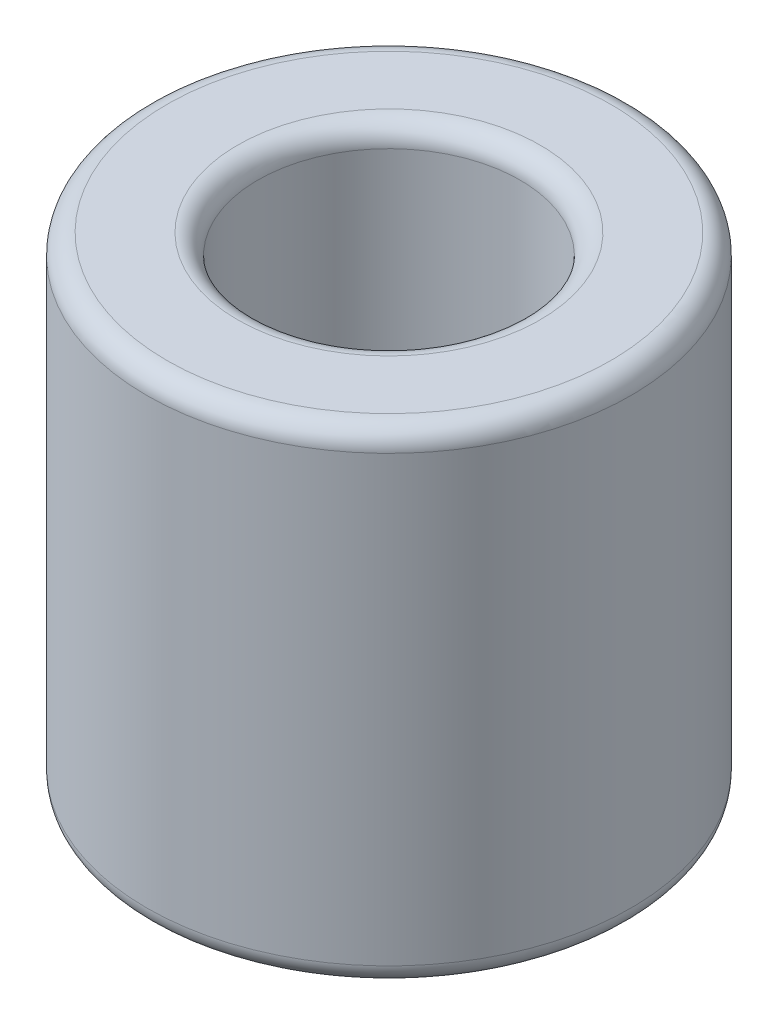
ISO-10303-21;
HEADER;
FILE_DESCRIPTION(('STEP AP214'),'2;1');
FILE_NAME('part.step','',(''),(''),'','','');
FILE_SCHEMA(('AUTOMOTIVE_DESIGN { 1 0 10303 214 1 1 1 1 }'));
ENDSEC;
DATA;
#1=APPLICATION_CONTEXT('core data for automotive mechanical design processes');
#2=APPLICATION_PROTOCOL_DEFINITION('international standard','automotive_design',2000,#1);
#3=PRODUCT_CONTEXT('',#1,'mechanical');
#4=PRODUCT('Part','Part','',(#3));
#5=PRODUCT_RELATED_PRODUCT_CATEGORY('part','',(#4));
#6=PRODUCT_DEFINITION_FORMATION('','',#4);
#7=PRODUCT_DEFINITION_CONTEXT('part definition',#1,'design');
#8=PRODUCT_DEFINITION('design','',#6,#7);
#9=PRODUCT_DEFINITION_SHAPE('','',#8);
#10=(LENGTH_UNIT() NAMED_UNIT(*) SI_UNIT(.MILLI.,.METRE.));
#11=(NAMED_UNIT(*) PLANE_ANGLE_UNIT() SI_UNIT($,.RADIAN.));
#12=(NAMED_UNIT(*) SI_UNIT($,.STERADIAN.) SOLID_ANGLE_UNIT());
#13=UNCERTAINTY_MEASURE_WITH_UNIT(LENGTH_MEASURE(1.E-05),#10,'distance_accuracy_value','');
#14=(GEOMETRIC_REPRESENTATION_CONTEXT(3) GLOBAL_UNCERTAINTY_ASSIGNED_CONTEXT((#13)) GLOBAL_UNIT_ASSIGNED_CONTEXT((#10,
#11,#12)) REPRESENTATION_CONTEXT('',''));
#15=CARTESIAN_POINT('',(0.,0.,0.));
#16=DIRECTION('',(0.,0.,1.));
#17=DIRECTION('',(1.,0.,0.));
#18=AXIS2_PLACEMENT_3D('',#15,#16,#17);
#19=CARTESIAN_POINT('',(0.,6.,0.));
#20=DIRECTION('',(0.,1.,0.));
#21=DIRECTION('',(0.,0.,1.));
#22=AXIS2_PLACEMENT_3D('',#19,#20,#21);
#23=PLANE('',#22);
#24=CARTESIAN_POINT('',(0.,6.,0.));
#25=DIRECTION('',(0.,1.,0.));
#26=DIRECTION('',(0.,0.,1.));
#27=AXIS2_PLACEMENT_3D('',#24,#25,#26);
#28=CIRCLE('',#27,1.875);
#29=CARTESIAN_POINT('',(0.,6.,1.875));
#30=VERTEX_POINT('',#29);
#31=EDGE_CURVE('E10',#30,#30,#28,.F.);
#32=ORIENTED_EDGE('',*,*,#31,.T.);
#33=EDGE_LOOP('',(#32));
#34=FACE_BOUND('',#33,.T.);
#35=CARTESIAN_POINT('',(0.,6.,0.));
#36=DIRECTION('',(0.,1.,0.));
#37=DIRECTION('',(0.,0.,1.));
#38=AXIS2_PLACEMENT_3D('',#35,#36,#37);
#39=CIRCLE('',#38,2.75);
#40=CARTESIAN_POINT('',(0.,6.,2.75));
#41=VERTEX_POINT('',#40);
#42=EDGE_CURVE('E39',#41,#41,#39,.T.);
#43=ORIENTED_EDGE('',*,*,#42,.T.);
#44=EDGE_LOOP('',(#43));
#45=FACE_BOUND('',#44,.T.);
#46=ADVANCED_FACE('F32',(#34,#45),#23,.T.);
#47=CARTESIAN_POINT('',(0.,0.,0.));
#48=DIRECTION('',(0.,1.,0.));
#49=DIRECTION('',(0.,0.,1.));
#50=AXIS2_PLACEMENT_3D('',#47,#48,#49);
#51=PLANE('',#50);
#52=CARTESIAN_POINT('',(0.,0.,0.));
#53=DIRECTION('',(0.,1.,0.));
#54=DIRECTION('',(0.,0.,1.));
#55=AXIS2_PLACEMENT_3D('',#52,#53,#54);
#56=CIRCLE('',#55,1.875);
#57=CARTESIAN_POINT('',(0.,0.,1.875));
#58=VERTEX_POINT('',#57);
#59=EDGE_CURVE('E58',#58,#58,#56,.T.);
#60=ORIENTED_EDGE('',*,*,#59,.T.);
#61=EDGE_LOOP('',(#60));
#62=FACE_BOUND('',#61,.T.);
#63=CARTESIAN_POINT('',(0.,0.,0.));
#64=DIRECTION('',(0.,1.,0.));
#65=DIRECTION('',(0.,0.,1.));
#66=AXIS2_PLACEMENT_3D('',#63,#64,#65);
#67=CIRCLE('',#66,2.75);
#68=CARTESIAN_POINT('',(0.,0.,2.75));
#69=VERTEX_POINT('',#68);
#70=EDGE_CURVE('E61',#69,#69,#67,.F.);
#71=ORIENTED_EDGE('',*,*,#70,.T.);
#72=EDGE_LOOP('',(#71));
#73=FACE_BOUND('',#72,.T.);
#74=ADVANCED_FACE('F65',(#62,#73),#51,.F.);
#75=CARTESIAN_POINT('',(0.,6.,0.));
#76=DIRECTION('',(0.,-1.,0.));
#77=DIRECTION('',(0.,0.,-1.));
#78=AXIS2_PLACEMENT_3D('',#75,#76,#77);
#79=CYLINDRICAL_SURFACE('',#78,3.);
#80=CARTESIAN_POINT('',(0.,0.25,0.));
#81=DIRECTION('',(0.,1.,0.));
#82=DIRECTION('',(0.,0.,1.));
#83=AXIS2_PLACEMENT_3D('',#80,#81,#82);
#84=CIRCLE('',#83,3.);
#85=CARTESIAN_POINT('',(0.,0.25,3.));
#86=VERTEX_POINT('',#85);
#87=EDGE_CURVE('E43',#86,#86,#84,.T.);
#88=ORIENTED_EDGE('',*,*,#87,.T.);
#89=EDGE_LOOP('',(#88));
#90=FACE_BOUND('',#89,.T.);
#91=CARTESIAN_POINT('',(0.,5.75,0.));
#92=DIRECTION('',(0.,1.,0.));
#93=DIRECTION('',(0.,0.,1.));
#94=AXIS2_PLACEMENT_3D('',#91,#92,#93);
#95=CIRCLE('',#94,3.);
#96=CARTESIAN_POINT('',(0.,5.75,3.));
#97=VERTEX_POINT('',#96);
#98=EDGE_CURVE('E47',#97,#97,#95,.F.);
#99=ORIENTED_EDGE('',*,*,#98,.T.);
#100=EDGE_LOOP('',(#99));
#101=FACE_BOUND('',#100,.T.);
#102=ADVANCED_FACE('F75',(#90,#101),#79,.T.);
#103=CARTESIAN_POINT('',(0.,6.,0.));
#104=DIRECTION('',(0.,-1.,0.));
#105=DIRECTION('',(0.,0.,-1.));
#106=AXIS2_PLACEMENT_3D('',#103,#104,#105);
#107=CYLINDRICAL_SURFACE('',#106,1.625);
#108=CARTESIAN_POINT('',(0.,0.25,0.));
#109=DIRECTION('',(0.,1.,0.));
#110=DIRECTION('',(0.,0.,1.));
#111=AXIS2_PLACEMENT_3D('',#108,#109,#110);
#112=CIRCLE('',#111,1.625);
#113=CARTESIAN_POINT('',(0.,0.25,1.625));
#114=VERTEX_POINT('',#113);
#115=EDGE_CURVE('E52',#114,#114,#112,.F.);
#116=ORIENTED_EDGE('',*,*,#115,.T.);
#117=EDGE_LOOP('',(#116));
#118=FACE_BOUND('',#117,.T.);
#119=CARTESIAN_POINT('',(0.,5.75,0.));
#120=DIRECTION('',(0.,1.,0.));
#121=DIRECTION('',(0.,0.,1.));
#122=AXIS2_PLACEMENT_3D('',#119,#120,#121);
#123=CIRCLE('',#122,1.625);
#124=CARTESIAN_POINT('',(0.,5.75,1.625));
#125=VERTEX_POINT('',#124);
#126=EDGE_CURVE('E55',#125,#125,#123,.T.);
#127=ORIENTED_EDGE('',*,*,#126,.T.);
#128=EDGE_LOOP('',(#127));
#129=FACE_BOUND('',#128,.T.);
#130=ADVANCED_FACE('F78',(#118,#129),#107,.F.);
#131=CARTESIAN_POINT('',(0.,0.25,0.));
#132=DIRECTION('',(0.,1.,0.));
#133=DIRECTION('',(0.,0.,1.));
#134=AXIS2_PLACEMENT_3D('',#131,#132,#133);
#135=TOROIDAL_SURFACE('',#134,1.875,0.25);
#136=ORIENTED_EDGE('',*,*,#115,.F.);
#137=EDGE_LOOP('',(#136));
#138=FACE_BOUND('',#137,.T.);
#139=ORIENTED_EDGE('',*,*,#59,.F.);
#140=EDGE_LOOP('',(#139));
#141=FACE_BOUND('',#140,.T.);
#142=ADVANCED_FACE('F71',(#138,#141),#135,.T.);
#143=CARTESIAN_POINT('',(0.,0.25,0.));
#144=DIRECTION('',(0.,1.,0.));
#145=DIRECTION('',(0.,0.,1.));
#146=AXIS2_PLACEMENT_3D('',#143,#144,#145);
#147=TOROIDAL_SURFACE('',#146,2.75,0.25);
#148=ORIENTED_EDGE('',*,*,#70,.F.);
#149=EDGE_LOOP('',(#148));
#150=FACE_BOUND('',#149,.T.);
#151=ORIENTED_EDGE('',*,*,#87,.F.);
#152=EDGE_LOOP('',(#151));
#153=FACE_BOUND('',#152,.T.);
#154=ADVANCED_FACE('F67',(#150,#153),#147,.T.);
#155=CARTESIAN_POINT('',(0.,5.75,0.));
#156=DIRECTION('',(0.,1.,0.));
#157=DIRECTION('',(0.,0.,1.));
#158=AXIS2_PLACEMENT_3D('',#155,#156,#157);
#159=TOROIDAL_SURFACE('',#158,1.875,0.25);
#160=ORIENTED_EDGE('',*,*,#31,.F.);
#161=EDGE_LOOP('',(#160));
#162=FACE_BOUND('',#161,.T.);
#163=ORIENTED_EDGE('',*,*,#126,.F.);
#164=EDGE_LOOP('',(#163));
#165=FACE_BOUND('',#164,.T.);
#166=ADVANCED_FACE('F70',(#162,#165),#159,.T.);
#167=CARTESIAN_POINT('',(0.,5.75,0.));
#168=DIRECTION('',(0.,1.,0.));
#169=DIRECTION('',(0.,0.,1.));
#170=AXIS2_PLACEMENT_3D('',#167,#168,#169);
#171=TOROIDAL_SURFACE('',#170,2.75,0.25);
#172=ORIENTED_EDGE('',*,*,#98,.F.);
#173=EDGE_LOOP('',(#172));
#174=FACE_BOUND('',#173,.T.);
#175=ORIENTED_EDGE('',*,*,#42,.F.);
#176=EDGE_LOOP('',(#175));
#177=FACE_BOUND('',#176,.T.);
#178=ADVANCED_FACE('F34',(#174,#177),#171,.T.);
#179=CLOSED_SHELL('',(#46,#74,#102,#130,#142,#154,#166,#178));
#180=MANIFOLD_SOLID_BREP('B2',#179);
#181=ADVANCED_BREP_SHAPE_REPRESENTATION('',(#18,#180),#14);
#182=SHAPE_DEFINITION_REPRESENTATION(#9,#181);
ENDSEC;
END-ISO-10303-21;
